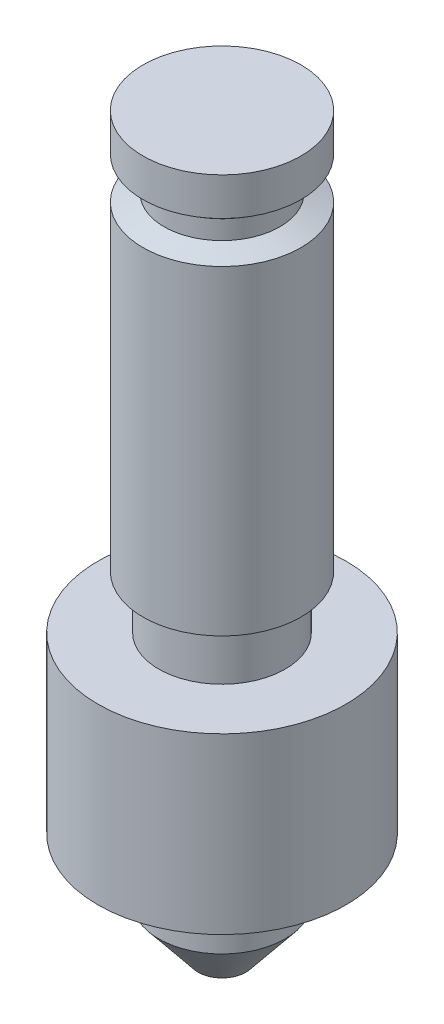
ISO-10303-21;
HEADER;
FILE_DESCRIPTION(('STEP AP214'),'2;1');
FILE_NAME('part.step','',(''),(''),'','','');
FILE_SCHEMA(('AUTOMOTIVE_DESIGN { 1 0 10303 214 1 1 1 1 }'));
ENDSEC;
DATA;
#1=APPLICATION_CONTEXT('core data for automotive mechanical design processes');
#2=APPLICATION_PROTOCOL_DEFINITION('international standard','automotive_design',2000,#1);
#3=PRODUCT_CONTEXT('',#1,'mechanical');
#4=PRODUCT('Part','Part','',(#3));
#5=PRODUCT_RELATED_PRODUCT_CATEGORY('part','',(#4));
#6=PRODUCT_DEFINITION_FORMATION('','',#4);
#7=PRODUCT_DEFINITION_CONTEXT('part definition',#1,'design');
#8=PRODUCT_DEFINITION('design','',#6,#7);
#9=PRODUCT_DEFINITION_SHAPE('','',#8);
#10=(LENGTH_UNIT() NAMED_UNIT(*) SI_UNIT(.MILLI.,.METRE.));
#11=(NAMED_UNIT(*) PLANE_ANGLE_UNIT() SI_UNIT($,.RADIAN.));
#12=(NAMED_UNIT(*) SI_UNIT($,.STERADIAN.) SOLID_ANGLE_UNIT());
#13=UNCERTAINTY_MEASURE_WITH_UNIT(LENGTH_MEASURE(1.E-05),#10,'distance_accuracy_value','');
#14=(GEOMETRIC_REPRESENTATION_CONTEXT(3) GLOBAL_UNCERTAINTY_ASSIGNED_CONTEXT((#13)) GLOBAL_UNIT_ASSIGNED_CONTEXT((#10,
#11,#12)) REPRESENTATION_CONTEXT('',''));
#15=CARTESIAN_POINT('',(0.,0.,0.));
#16=DIRECTION('',(0.,0.,1.));
#17=DIRECTION('',(1.,0.,0.));
#18=AXIS2_PLACEMENT_3D('',#15,#16,#17);
#19=CARTESIAN_POINT('',(0.,0.,0.));
#20=DIRECTION('',(0.,-1.,0.));
#21=DIRECTION('',(0.,0.,-1.));
#22=AXIS2_PLACEMENT_3D('',#19,#20,#21);
#23=PLANE('',#22);
#24=CARTESIAN_POINT('',(0.,0.,0.));
#25=DIRECTION('',(0.,-1.,0.));
#26=DIRECTION('',(0.,0.,-1.));
#27=AXIS2_PLACEMENT_3D('',#24,#25,#26);
#28=CIRCLE('',#27,7.96290000000001);
#29=CARTESIAN_POINT('',(0.,0.,-7.96290000000001));
#30=VERTEX_POINT('',#29);
#31=EDGE_CURVE('E10',#30,#30,#28,.T.);
#32=ORIENTED_EDGE('',*,*,#31,.F.);
#33=EDGE_LOOP('',(#32));
#34=FACE_BOUND('',#33,.T.);
#35=ADVANCED_FACE('F31',(#34),#23,.F.);
#36=CARTESIAN_POINT('',(0.,0.,0.));
#37=DIRECTION('',(0.,-1.,0.));
#38=DIRECTION('',(0.,0.,-1.));
#39=AXIS2_PLACEMENT_3D('',#36,#37,#38);
#40=CYLINDRICAL_SURFACE('',#39,7.9629);
#41=CARTESIAN_POINT('',(0.,-3.81,0.));
#42=DIRECTION('',(0.,-1.,0.));
#43=DIRECTION('',(0.,0.,-1.));
#44=AXIS2_PLACEMENT_3D('',#41,#42,#43);
#45=CIRCLE('',#44,7.9629);
#46=CARTESIAN_POINT('',(0.,-3.81,-7.9629));
#47=VERTEX_POINT('',#46);
#48=EDGE_CURVE('E37',#47,#47,#45,.T.);
#49=ORIENTED_EDGE('',*,*,#48,.F.);
#50=EDGE_LOOP('',(#49));
#51=FACE_BOUND('',#50,.T.);
#52=ORIENTED_EDGE('',*,*,#31,.T.);
#53=EDGE_LOOP('',(#52));
#54=FACE_BOUND('',#53,.T.);
#55=ADVANCED_FACE('F142',(#51,#54),#40,.T.);
#56=CARTESIAN_POINT('',(0.,-3.81,0.));
#57=DIRECTION('',(0.,1.,0.));
#58=DIRECTION('',(0.,0.,1.));
#59=AXIS2_PLACEMENT_3D('',#56,#57,#58);
#60=CONICAL_SURFACE('',#59,7.9629,0.947720392714103);
#61=CARTESIAN_POINT('',(0.,-5.334,0.));
#62=DIRECTION('',(0.,-1.,0.));
#63=DIRECTION('',(0.,0.,-1.));
#64=AXIS2_PLACEMENT_3D('',#61,#62,#63);
#65=CIRCLE('',#64,5.842);
#66=CARTESIAN_POINT('',(0.,-5.334,-5.842));
#67=VERTEX_POINT('',#66);
#68=EDGE_CURVE('E41',#67,#67,#65,.T.);
#69=ORIENTED_EDGE('',*,*,#68,.F.);
#70=EDGE_LOOP('',(#69));
#71=FACE_BOUND('',#70,.T.);
#72=ORIENTED_EDGE('',*,*,#48,.T.);
#73=EDGE_LOOP('',(#72));
#74=FACE_BOUND('',#73,.T.);
#75=ADVANCED_FACE('F137',(#71,#74),#60,.T.);
#76=CARTESIAN_POINT('',(0.,0.,0.));
#77=DIRECTION('',(0.,-1.,0.));
#78=DIRECTION('',(0.,0.,-1.));
#79=AXIS2_PLACEMENT_3D('',#76,#77,#78);
#80=CYLINDRICAL_SURFACE('',#79,5.842);
#81=CARTESIAN_POINT('',(0.,-7.239,0.));
#82=DIRECTION('',(0.,-1.,0.));
#83=DIRECTION('',(0.,0.,-1.));
#84=AXIS2_PLACEMENT_3D('',#81,#82,#83);
#85=CIRCLE('',#84,5.842);
#86=CARTESIAN_POINT('',(0.,-7.239,-5.842));
#87=VERTEX_POINT('',#86);
#88=EDGE_CURVE('E45',#87,#87,#85,.T.);
#89=ORIENTED_EDGE('',*,*,#88,.F.);
#90=EDGE_LOOP('',(#89));
#91=FACE_BOUND('',#90,.T.);
#92=ORIENTED_EDGE('',*,*,#68,.T.);
#93=EDGE_LOOP('',(#92));
#94=FACE_BOUND('',#93,.T.);
#95=ADVANCED_FACE('F131',(#91,#94),#80,.T.);
#96=CARTESIAN_POINT('',(0.,-7.239,0.));
#97=DIRECTION('',(0.,-1.,0.));
#98=DIRECTION('',(0.,0.,-1.));
#99=AXIS2_PLACEMENT_3D('',#96,#97,#98);
#100=CONICAL_SURFACE('',#99,5.842,1.22587701335956);
#101=CARTESIAN_POINT('',(0.,-8.001,0.));
#102=DIRECTION('',(0.,-1.,0.));
#103=DIRECTION('',(0.,0.,-1.));
#104=AXIS2_PLACEMENT_3D('',#101,#102,#103);
#105=CIRCLE('',#104,7.9629);
#106=CARTESIAN_POINT('',(0.,-8.001,-7.9629));
#107=VERTEX_POINT('',#106);
#108=EDGE_CURVE('E50',#107,#107,#105,.T.);
#109=ORIENTED_EDGE('',*,*,#108,.F.);
#110=EDGE_LOOP('',(#109));
#111=FACE_BOUND('',#110,.T.);
#112=ORIENTED_EDGE('',*,*,#88,.T.);
#113=EDGE_LOOP('',(#112));
#114=FACE_BOUND('',#113,.T.);
#115=ADVANCED_FACE('F125',(#111,#114),#100,.T.);
#116=CARTESIAN_POINT('',(0.,0.,0.));
#117=DIRECTION('',(0.,-1.,0.));
#118=DIRECTION('',(0.,0.,-1.));
#119=AXIS2_PLACEMENT_3D('',#116,#117,#118);
#120=CYLINDRICAL_SURFACE('',#119,7.9629);
#121=CARTESIAN_POINT('',(0.,-40.259,0.));
#122=DIRECTION('',(0.,-1.,0.));
#123=DIRECTION('',(0.,0.,-1.));
#124=AXIS2_PLACEMENT_3D('',#121,#122,#123);
#125=CIRCLE('',#124,7.9629);
#126=CARTESIAN_POINT('',(0.,-40.259,-7.9629));
#127=VERTEX_POINT('',#126);
#128=EDGE_CURVE('E53',#127,#127,#125,.T.);
#129=ORIENTED_EDGE('',*,*,#128,.F.);
#130=EDGE_LOOP('',(#129));
#131=FACE_BOUND('',#130,.T.);
#132=ORIENTED_EDGE('',*,*,#108,.T.);
#133=EDGE_LOOP('',(#132));
#134=FACE_BOUND('',#133,.T.);
#135=ADVANCED_FACE('F119',(#131,#134),#120,.T.);
#136=CARTESIAN_POINT('',(-7.9629,-40.259,0.));
#137=DIRECTION('',(0.,1.,0.));
#138=DIRECTION('',(0.,0.,1.));
#139=AXIS2_PLACEMENT_3D('',#136,#137,#138);
#140=PLANE('',#139);
#141=CARTESIAN_POINT('',(0.,-40.259,0.));
#142=DIRECTION('',(0.,-1.,0.));
#143=DIRECTION('',(0.,0.,-1.));
#144=AXIS2_PLACEMENT_3D('',#141,#142,#143);
#145=CIRCLE('',#144,6.37539999999999);
#146=CARTESIAN_POINT('',(0.,-40.259,-6.37539999999999));
#147=VERTEX_POINT('',#146);
#148=EDGE_CURVE('E56',#147,#147,#145,.T.);
#149=ORIENTED_EDGE('',*,*,#148,.F.);
#150=EDGE_LOOP('',(#149));
#151=FACE_BOUND('',#150,.T.);
#152=ORIENTED_EDGE('',*,*,#128,.T.);
#153=EDGE_LOOP('',(#152));
#154=FACE_BOUND('',#153,.T.);
#155=ADVANCED_FACE('F113',(#151,#154),#140,.F.);
#156=CARTESIAN_POINT('',(0.,0.,0.));
#157=DIRECTION('',(0.,-1.,0.));
#158=DIRECTION('',(0.,0.,-1.));
#159=AXIS2_PLACEMENT_3D('',#156,#157,#158);
#160=CYLINDRICAL_SURFACE('',#159,6.37539999999999);
#161=CARTESIAN_POINT('',(0.,-45.593,0.));
#162=DIRECTION('',(0.,-1.,0.));
#163=DIRECTION('',(0.,0.,-1.));
#164=AXIS2_PLACEMENT_3D('',#161,#162,#163);
#165=CIRCLE('',#164,6.37539999999999);
#166=CARTESIAN_POINT('',(0.,-45.593,-6.37539999999999));
#167=VERTEX_POINT('',#166);
#168=EDGE_CURVE('E59',#167,#167,#165,.T.);
#169=ORIENTED_EDGE('',*,*,#168,.F.);
#170=EDGE_LOOP('',(#169));
#171=FACE_BOUND('',#170,.T.);
#172=ORIENTED_EDGE('',*,*,#148,.T.);
#173=EDGE_LOOP('',(#172));
#174=FACE_BOUND('',#173,.T.);
#175=ADVANCED_FACE('F107',(#171,#174),#160,.T.);
#176=CARTESIAN_POINT('',(-6.37539999999999,-45.593,0.));
#177=DIRECTION('',(0.,-1.,0.));
#178=DIRECTION('',(0.,0.,-1.));
#179=AXIS2_PLACEMENT_3D('',#176,#177,#178);
#180=PLANE('',#179);
#181=CARTESIAN_POINT('',(0.,-45.593,0.));
#182=DIRECTION('',(0.,-1.,0.));
#183=DIRECTION('',(0.,0.,-1.));
#184=AXIS2_PLACEMENT_3D('',#181,#182,#183);
#185=CIRCLE('',#184,12.5);
#186=CARTESIAN_POINT('',(0.,-45.593,-12.5));
#187=VERTEX_POINT('',#186);
#188=EDGE_CURVE('E62',#187,#187,#185,.T.);
#189=ORIENTED_EDGE('',*,*,#188,.F.);
#190=EDGE_LOOP('',(#189));
#191=FACE_BOUND('',#190,.T.);
#192=ORIENTED_EDGE('',*,*,#168,.T.);
#193=EDGE_LOOP('',(#192));
#194=FACE_BOUND('',#193,.T.);
#195=ADVANCED_FACE('F101',(#191,#194),#180,.F.);
#196=CARTESIAN_POINT('',(0.,0.,0.));
#197=DIRECTION('',(0.,-1.,0.));
#198=DIRECTION('',(0.,0.,-1.));
#199=AXIS2_PLACEMENT_3D('',#196,#197,#198);
#200=CYLINDRICAL_SURFACE('',#199,12.5);
#201=CARTESIAN_POINT('',(0.,-63.119,0.));
#202=DIRECTION('',(0.,-1.,0.));
#203=DIRECTION('',(0.,0.,-1.));
#204=AXIS2_PLACEMENT_3D('',#201,#202,#203);
#205=CIRCLE('',#204,12.5);
#206=CARTESIAN_POINT('',(0.,-63.119,-12.5));
#207=VERTEX_POINT('',#206);
#208=EDGE_CURVE('E65',#207,#207,#205,.T.);
#209=ORIENTED_EDGE('',*,*,#208,.F.);
#210=EDGE_LOOP('',(#209));
#211=FACE_BOUND('',#210,.T.);
#212=ORIENTED_EDGE('',*,*,#188,.T.);
#213=EDGE_LOOP('',(#212));
#214=FACE_BOUND('',#213,.T.);
#215=ADVANCED_FACE('F95',(#211,#214),#200,.T.);
#216=CARTESIAN_POINT('',(-12.5,-63.119,0.));
#217=DIRECTION('',(0.,1.,0.));
#218=DIRECTION('',(0.,0.,1.));
#219=AXIS2_PLACEMENT_3D('',#216,#217,#218);
#220=PLANE('',#219);
#221=CARTESIAN_POINT('',(0.,-63.119,0.));
#222=DIRECTION('',(0.,-1.,0.));
#223=DIRECTION('',(0.,0.,-1.));
#224=AXIS2_PLACEMENT_3D('',#221,#222,#223);
#225=CIRCLE('',#224,6.37539999999999);
#226=CARTESIAN_POINT('',(0.,-63.119,-6.37539999999999));
#227=VERTEX_POINT('',#226);
#228=EDGE_CURVE('E68',#227,#227,#225,.T.);
#229=ORIENTED_EDGE('',*,*,#228,.F.);
#230=EDGE_LOOP('',(#229));
#231=FACE_BOUND('',#230,.T.);
#232=ORIENTED_EDGE('',*,*,#208,.T.);
#233=EDGE_LOOP('',(#232));
#234=FACE_BOUND('',#233,.T.);
#235=ADVANCED_FACE('F89',(#231,#234),#220,.F.);
#236=CARTESIAN_POINT('',(0.,0.,0.));
#237=DIRECTION('',(0.,-1.,0.));
#238=DIRECTION('',(0.,0.,-1.));
#239=AXIS2_PLACEMENT_3D('',#236,#237,#238);
#240=CYLINDRICAL_SURFACE('',#239,6.37539999999999);
#241=CARTESIAN_POINT('',(0.,-69.142247750506,0.));
#242=DIRECTION('',(0.,-1.,0.));
#243=DIRECTION('',(0.,0.,-1.));
#244=AXIS2_PLACEMENT_3D('',#241,#242,#243);
#245=CIRCLE('',#244,6.37539999999999);
#246=CARTESIAN_POINT('',(0.,-69.142247750506,-6.37539999999999));
#247=VERTEX_POINT('',#246);
#248=EDGE_CURVE('E71',#247,#247,#245,.T.);
#249=ORIENTED_EDGE('',*,*,#248,.F.);
#250=EDGE_LOOP('',(#249));
#251=FACE_BOUND('',#250,.T.);
#252=ORIENTED_EDGE('',*,*,#228,.T.);
#253=EDGE_LOOP('',(#252));
#254=FACE_BOUND('',#253,.T.);
#255=ADVANCED_FACE('F83',(#251,#254),#240,.T.);
#256=CARTESIAN_POINT('',(0.,-69.142247750506,0.));
#257=DIRECTION('',(0.,1.,0.));
#258=DIRECTION('',(0.,0.,1.));
#259=AXIS2_PLACEMENT_3D('',#256,#257,#258);
#260=CONICAL_SURFACE('',#259,6.37539999999999,0.68041348783825);
#261=CARTESIAN_POINT('',(0.,-74.041,0.));
#262=DIRECTION('',(0.,-1.,0.));
#263=DIRECTION('',(0.,0.,-1.));
#264=AXIS2_PLACEMENT_3D('',#261,#262,#263);
#265=CIRCLE('',#264,2.41061698375791);
#266=CARTESIAN_POINT('',(0.,-74.041,-2.41061698375791));
#267=VERTEX_POINT('',#266);
#268=EDGE_CURVE('E74',#267,#267,#265,.T.);
#269=ORIENTED_EDGE('',*,*,#268,.F.);
#270=EDGE_LOOP('',(#269));
#271=FACE_BOUND('',#270,.T.);
#272=ORIENTED_EDGE('',*,*,#248,.T.);
#273=EDGE_LOOP('',(#272));
#274=FACE_BOUND('',#273,.T.);
#275=ADVANCED_FACE('F80',(#271,#274),#260,.T.);
#276=CARTESIAN_POINT('',(-2.41061698375791,-74.041,0.));
#277=DIRECTION('',(0.,1.,0.));
#278=DIRECTION('',(0.,0.,1.));
#279=AXIS2_PLACEMENT_3D('',#276,#277,#278);
#280=PLANE('',#279);
#281=ORIENTED_EDGE('',*,*,#268,.T.);
#282=EDGE_LOOP('',(#281));
#283=FACE_BOUND('',#282,.T.);
#284=ADVANCED_FACE('F78',(#283),#280,.F.);
#285=CLOSED_SHELL('',(#35,#55,#75,#95,#115,#135,#155,#175,#195,#215,#235,#255,#275,#284));
#286=MANIFOLD_SOLID_BREP('B2',#285);
#287=ADVANCED_BREP_SHAPE_REPRESENTATION('',(#18,#286),#14);
#288=SHAPE_DEFINITION_REPRESENTATION(#9,#287);
ENDSEC;
END-ISO-10303-21;
